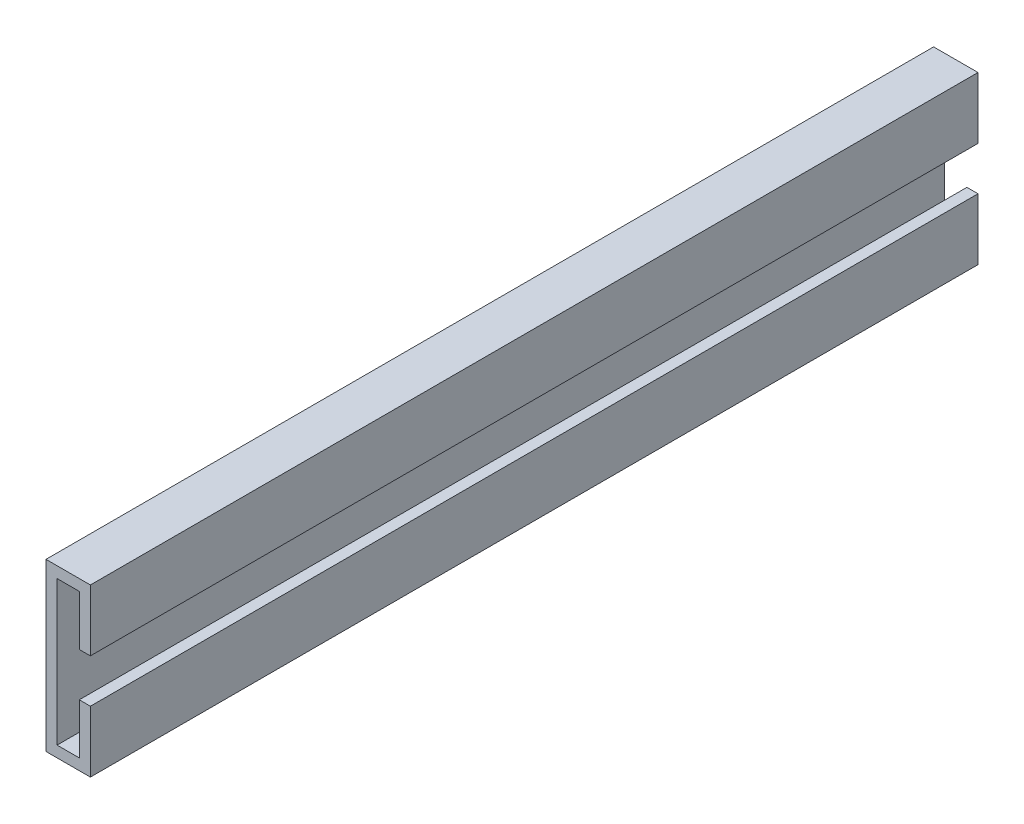
ISO-10303-21;
HEADER;
FILE_DESCRIPTION(('STEP AP214'),'2;1');
FILE_NAME('part.step','',(''),(''),'','','');
FILE_SCHEMA(('AUTOMOTIVE_DESIGN { 1 0 10303 214 1 1 1 1 }'));
ENDSEC;
DATA;
#1=APPLICATION_CONTEXT('core data for automotive mechanical design processes');
#2=APPLICATION_PROTOCOL_DEFINITION('international standard','automotive_design',2000,#1);
#3=PRODUCT_CONTEXT('',#1,'mechanical');
#4=PRODUCT('Part','Part','',(#3));
#5=PRODUCT_RELATED_PRODUCT_CATEGORY('part','',(#4));
#6=PRODUCT_DEFINITION_FORMATION('','',#4);
#7=PRODUCT_DEFINITION_CONTEXT('part definition',#1,'design');
#8=PRODUCT_DEFINITION('design','',#6,#7);
#9=PRODUCT_DEFINITION_SHAPE('','',#8);
#10=(LENGTH_UNIT() NAMED_UNIT(*) SI_UNIT(.MILLI.,.METRE.));
#11=(NAMED_UNIT(*) PLANE_ANGLE_UNIT() SI_UNIT($,.RADIAN.));
#12=(NAMED_UNIT(*) SI_UNIT($,.STERADIAN.) SOLID_ANGLE_UNIT());
#13=UNCERTAINTY_MEASURE_WITH_UNIT(LENGTH_MEASURE(1.E-05),#10,'distance_accuracy_value','');
#14=(GEOMETRIC_REPRESENTATION_CONTEXT(3) GLOBAL_UNCERTAINTY_ASSIGNED_CONTEXT((#13)) GLOBAL_UNIT_ASSIGNED_CONTEXT((#10,
#11,#12)) REPRESENTATION_CONTEXT('',''));
#15=CARTESIAN_POINT('',(0.,0.,0.));
#16=DIRECTION('',(0.,0.,1.));
#17=DIRECTION('',(1.,0.,0.));
#18=AXIS2_PLACEMENT_3D('',#15,#16,#17);
#19=CARTESIAN_POINT('',(0.,65.,400.));
#20=DIRECTION('',(0.,1.,0.));
#21=DIRECTION('',(0.,0.,1.));
#22=AXIS2_PLACEMENT_3D('',#19,#20,#21);
#23=PLANE('',#22);
#24=DIRECTION('',(1.,0.,0.));
#25=VECTOR('',#24,1.);
#26=CARTESIAN_POINT('',(0.,65.,-400.));
#27=LINE('',#26,#25);
#28=CARTESIAN_POINT('',(0.,65.,-400.));
#29=VERTEX_POINT('',#28);
#30=CARTESIAN_POINT('',(20.,65.,-400.));
#31=VERTEX_POINT('',#30);
#32=EDGE_CURVE('E164',#29,#31,#27,.T.);
#33=ORIENTED_EDGE('',*,*,#32,.T.);
#34=DIRECTION('',(0.,0.,-1.));
#35=VECTOR('',#34,1.);
#36=CARTESIAN_POINT('',(20.,65.,400.));
#37=LINE('',#36,#35);
#38=CARTESIAN_POINT('',(20.,65.,400.));
#39=VERTEX_POINT('',#38);
#40=EDGE_CURVE('E11',#39,#31,#37,.T.);
#41=ORIENTED_EDGE('',*,*,#40,.F.);
#42=DIRECTION('',(1.,0.,0.));
#43=VECTOR('',#42,1.);
#44=CARTESIAN_POINT('',(0.,65.,400.));
#45=LINE('',#44,#43);
#46=CARTESIAN_POINT('',(0.,65.,400.));
#47=VERTEX_POINT('',#46);
#48=EDGE_CURVE('E198',#47,#39,#45,.T.);
#49=ORIENTED_EDGE('',*,*,#48,.F.);
#50=DIRECTION('',(0.,0.,-1.));
#51=VECTOR('',#50,1.);
#52=CARTESIAN_POINT('',(0.,65.,400.));
#53=LINE('',#52,#51);
#54=EDGE_CURVE('E160',#47,#29,#53,.T.);
#55=ORIENTED_EDGE('',*,*,#54,.T.);
#56=EDGE_LOOP('',(#33,#41,#49,#55));
#57=FACE_BOUND('',#56,.T.);
#58=ADVANCED_FACE('F39',(#57),#23,.F.);
#59=CARTESIAN_POINT('',(20.,65.,400.));
#60=DIRECTION('',(1.,0.,0.));
#61=DIRECTION('',(0.,0.,-1.));
#62=AXIS2_PLACEMENT_3D('',#59,#60,#61);
#63=PLANE('',#62);
#64=DIRECTION('',(0.,-1.,0.));
#65=VECTOR('',#64,1.);
#66=CARTESIAN_POINT('',(20.,65.,-400.));
#67=LINE('',#66,#65);
#68=CARTESIAN_POINT('',(20.,19.6422644871285,-400.));
#69=VERTEX_POINT('',#68);
#70=EDGE_CURVE('E168',#31,#69,#67,.T.);
#71=ORIENTED_EDGE('',*,*,#70,.T.);
#72=DIRECTION('',(0.,0.,-1.));
#73=VECTOR('',#72,1.);
#74=CARTESIAN_POINT('',(20.,19.6422644871285,400.));
#75=LINE('',#74,#73);
#76=CARTESIAN_POINT('',(20.,19.6422644871285,400.));
#77=VERTEX_POINT('',#76);
#78=EDGE_CURVE('E48',#77,#69,#75,.T.);
#79=ORIENTED_EDGE('',*,*,#78,.F.);
#80=DIRECTION('',(0.,-1.,0.));
#81=VECTOR('',#80,1.);
#82=CARTESIAN_POINT('',(20.,65.,400.));
#83=LINE('',#82,#81);
#84=EDGE_CURVE('E111',#39,#77,#83,.T.);
#85=ORIENTED_EDGE('',*,*,#84,.F.);
#86=ORIENTED_EDGE('',*,*,#40,.T.);
#87=EDGE_LOOP('',(#71,#79,#85,#86));
#88=FACE_BOUND('',#87,.T.);
#89=ADVANCED_FACE('F292',(#88),#63,.F.);
#90=CARTESIAN_POINT('',(20.,19.6422644871285,400.));
#91=DIRECTION('',(0.,1.,0.));
#92=DIRECTION('',(-1.,0.,0.));
#93=AXIS2_PLACEMENT_3D('',#90,#91,#92);
#94=PLANE('',#93);
#95=DIRECTION('',(1.,0.,0.));
#96=VECTOR('',#95,1.);
#97=CARTESIAN_POINT('',(20.,19.6422644871285,-400.));
#98=LINE('',#97,#96);
#99=CARTESIAN_POINT('',(30.,19.6422644871285,-400.));
#100=VERTEX_POINT('',#99);
#101=EDGE_CURVE('E171',#69,#100,#98,.T.);
#102=ORIENTED_EDGE('',*,*,#101,.T.);
#103=DIRECTION('',(0.,0.,-1.));
#104=VECTOR('',#103,1.);
#105=CARTESIAN_POINT('',(30.,19.6422644871285,400.));
#106=LINE('',#105,#104);
#107=CARTESIAN_POINT('',(30.,19.6422644871285,400.));
#108=VERTEX_POINT('',#107);
#109=EDGE_CURVE('E225',#108,#100,#106,.T.);
#110=ORIENTED_EDGE('',*,*,#109,.F.);
#111=DIRECTION('',(1.,0.,0.));
#112=VECTOR('',#111,1.);
#113=CARTESIAN_POINT('',(20.,19.6422644871285,400.));
#114=LINE('',#113,#112);
#115=EDGE_CURVE('E235',#77,#108,#114,.T.);
#116=ORIENTED_EDGE('',*,*,#115,.F.);
#117=ORIENTED_EDGE('',*,*,#78,.T.);
#118=EDGE_LOOP('',(#102,#110,#116,#117));
#119=FACE_BOUND('',#118,.T.);
#120=ADVANCED_FACE('F233',(#119),#94,.F.);
#121=CARTESIAN_POINT('',(30.,19.6422644871285,400.));
#122=DIRECTION('',(-1.,0.,0.));
#123=DIRECTION('',(0.,0.,1.));
#124=AXIS2_PLACEMENT_3D('',#121,#122,#123);
#125=PLANE('',#124);
#126=DIRECTION('',(0.,1.,0.));
#127=VECTOR('',#126,1.);
#128=CARTESIAN_POINT('',(30.,19.6422644871285,-400.));
#129=LINE('',#128,#127);
#130=CARTESIAN_POINT('',(30.,75.,-400.));
#131=VERTEX_POINT('',#130);
#132=EDGE_CURVE('E174',#100,#131,#129,.T.);
#133=ORIENTED_EDGE('',*,*,#132,.T.);
#134=DIRECTION('',(0.,0.,-1.));
#135=VECTOR('',#134,1.);
#136=CARTESIAN_POINT('',(30.,75.,400.));
#137=LINE('',#136,#135);
#138=CARTESIAN_POINT('',(30.,75.,400.));
#139=VERTEX_POINT('',#138);
#140=EDGE_CURVE('E221',#139,#131,#137,.T.);
#141=ORIENTED_EDGE('',*,*,#140,.F.);
#142=DIRECTION('',(0.,1.,0.));
#143=VECTOR('',#142,1.);
#144=CARTESIAN_POINT('',(30.,19.6422644871285,400.));
#145=LINE('',#144,#143);
#146=EDGE_CURVE('E254',#108,#139,#145,.T.);
#147=ORIENTED_EDGE('',*,*,#146,.F.);
#148=ORIENTED_EDGE('',*,*,#109,.T.);
#149=EDGE_LOOP('',(#133,#141,#147,#148));
#150=FACE_BOUND('',#149,.T.);
#151=ADVANCED_FACE('F244',(#150),#125,.F.);
#152=CARTESIAN_POINT('',(30.,75.,400.));
#153=DIRECTION('',(0.,-1.,0.));
#154=DIRECTION('',(0.,0.,-1.));
#155=AXIS2_PLACEMENT_3D('',#152,#153,#154);
#156=PLANE('',#155);
#157=DIRECTION('',(-1.,0.,0.));
#158=VECTOR('',#157,1.);
#159=CARTESIAN_POINT('',(30.,75.,-400.));
#160=LINE('',#159,#158);
#161=CARTESIAN_POINT('',(-10.,75.,-400.));
#162=VERTEX_POINT('',#161);
#163=EDGE_CURVE('E177',#131,#162,#160,.T.);
#164=ORIENTED_EDGE('',*,*,#163,.T.);
#165=DIRECTION('',(0.,0.,-1.));
#166=VECTOR('',#165,1.);
#167=CARTESIAN_POINT('',(-10.,75.,400.));
#168=LINE('',#167,#166);
#169=CARTESIAN_POINT('',(-10.,75.,400.));
#170=VERTEX_POINT('',#169);
#171=EDGE_CURVE('E217',#170,#162,#168,.T.);
#172=ORIENTED_EDGE('',*,*,#171,.F.);
#173=DIRECTION('',(-1.,0.,0.));
#174=VECTOR('',#173,1.);
#175=CARTESIAN_POINT('',(30.,75.,400.));
#176=LINE('',#175,#174);
#177=EDGE_CURVE('E250',#139,#170,#176,.T.);
#178=ORIENTED_EDGE('',*,*,#177,.F.);
#179=ORIENTED_EDGE('',*,*,#140,.T.);
#180=EDGE_LOOP('',(#164,#172,#178,#179));
#181=FACE_BOUND('',#180,.T.);
#182=ADVANCED_FACE('F248',(#181),#156,.F.);
#183=CARTESIAN_POINT('',(-10.,75.,400.));
#184=DIRECTION('',(1.,0.,0.));
#185=DIRECTION('',(0.,0.,-1.));
#186=AXIS2_PLACEMENT_3D('',#183,#184,#185);
#187=PLANE('',#186);
#188=DIRECTION('',(0.,-1.,0.));
#189=VECTOR('',#188,1.);
#190=CARTESIAN_POINT('',(-10.,75.,-400.));
#191=LINE('',#190,#189);
#192=CARTESIAN_POINT('',(-10.,-75.,-400.));
#193=VERTEX_POINT('',#192);
#194=EDGE_CURVE('E180',#162,#193,#191,.T.);
#195=ORIENTED_EDGE('',*,*,#194,.T.);
#196=DIRECTION('',(0.,0.,-1.));
#197=VECTOR('',#196,1.);
#198=CARTESIAN_POINT('',(-10.,-75.,400.));
#199=LINE('',#198,#197);
#200=CARTESIAN_POINT('',(-10.,-75.,400.));
#201=VERTEX_POINT('',#200);
#202=EDGE_CURVE('E213',#201,#193,#199,.T.);
#203=ORIENTED_EDGE('',*,*,#202,.F.);
#204=DIRECTION('',(0.,-1.,0.));
#205=VECTOR('',#204,1.);
#206=CARTESIAN_POINT('',(-10.,75.,400.));
#207=LINE('',#206,#205);
#208=EDGE_CURVE('E253',#170,#201,#207,.T.);
#209=ORIENTED_EDGE('',*,*,#208,.F.);
#210=ORIENTED_EDGE('',*,*,#171,.T.);
#211=EDGE_LOOP('',(#195,#203,#209,#210));
#212=FACE_BOUND('',#211,.T.);
#213=ADVANCED_FACE('F305',(#212),#187,.F.);
#214=CARTESIAN_POINT('',(30.,-75.,400.));
#215=DIRECTION('',(0.,1.,0.));
#216=DIRECTION('',(0.,0.,1.));
#217=AXIS2_PLACEMENT_3D('',#214,#215,#216);
#218=PLANE('',#217);
#219=DIRECTION('',(1.,0.,0.));
#220=VECTOR('',#219,1.);
#221=CARTESIAN_POINT('',(30.,-75.,-400.));
#222=LINE('',#221,#220);
#223=CARTESIAN_POINT('',(30.,-75.,-400.));
#224=VERTEX_POINT('',#223);
#225=EDGE_CURVE('E183',#193,#224,#222,.T.);
#226=ORIENTED_EDGE('',*,*,#225,.T.);
#227=DIRECTION('',(0.,0.,-1.));
#228=VECTOR('',#227,1.);
#229=CARTESIAN_POINT('',(30.,-75.,400.));
#230=LINE('',#229,#228);
#231=CARTESIAN_POINT('',(30.,-75.,400.));
#232=VERTEX_POINT('',#231);
#233=EDGE_CURVE('E209',#232,#224,#230,.T.);
#234=ORIENTED_EDGE('',*,*,#233,.F.);
#235=DIRECTION('',(1.,0.,0.));
#236=VECTOR('',#235,1.);
#237=CARTESIAN_POINT('',(30.,-75.,400.));
#238=LINE('',#237,#236);
#239=EDGE_CURVE('E258',#201,#232,#238,.T.);
#240=ORIENTED_EDGE('',*,*,#239,.F.);
#241=ORIENTED_EDGE('',*,*,#202,.T.);
#242=EDGE_LOOP('',(#226,#234,#240,#241));
#243=FACE_BOUND('',#242,.T.);
#244=ADVANCED_FACE('F308',(#243),#218,.F.);
#245=CARTESIAN_POINT('',(30.,-19.6422644871285,400.));
#246=DIRECTION('',(-1.,0.,0.));
#247=DIRECTION('',(0.,0.,1.));
#248=AXIS2_PLACEMENT_3D('',#245,#246,#247);
#249=PLANE('',#248);
#250=DIRECTION('',(0.,1.,0.));
#251=VECTOR('',#250,1.);
#252=CARTESIAN_POINT('',(30.,-19.6422644871285,-400.));
#253=LINE('',#252,#251);
#254=CARTESIAN_POINT('',(30.,-19.6422644871285,-400.));
#255=VERTEX_POINT('',#254);
#256=EDGE_CURVE('E186',#224,#255,#253,.T.);
#257=ORIENTED_EDGE('',*,*,#256,.T.);
#258=DIRECTION('',(0.,0.,-1.));
#259=VECTOR('',#258,1.);
#260=CARTESIAN_POINT('',(30.,-19.6422644871285,400.));
#261=LINE('',#260,#259);
#262=CARTESIAN_POINT('',(30.,-19.6422644871285,400.));
#263=VERTEX_POINT('',#262);
#264=EDGE_CURVE('E205',#263,#255,#261,.T.);
#265=ORIENTED_EDGE('',*,*,#264,.F.);
#266=DIRECTION('',(0.,1.,0.));
#267=VECTOR('',#266,1.);
#268=CARTESIAN_POINT('',(30.,-19.6422644871285,400.));
#269=LINE('',#268,#267);
#270=EDGE_CURVE('E265',#232,#263,#269,.T.);
#271=ORIENTED_EDGE('',*,*,#270,.F.);
#272=ORIENTED_EDGE('',*,*,#233,.T.);
#273=EDGE_LOOP('',(#257,#265,#271,#272));
#274=FACE_BOUND('',#273,.T.);
#275=ADVANCED_FACE('F273',(#274),#249,.F.);
#276=CARTESIAN_POINT('',(20.,-19.6422644871285,400.));
#277=DIRECTION('',(0.,-1.,0.));
#278=DIRECTION('',(1.,0.,0.));
#279=AXIS2_PLACEMENT_3D('',#276,#277,#278);
#280=PLANE('',#279);
#281=DIRECTION('',(-1.,0.,0.));
#282=VECTOR('',#281,1.);
#283=CARTESIAN_POINT('',(20.,-19.6422644871285,-400.));
#284=LINE('',#283,#282);
#285=CARTESIAN_POINT('',(20.,-19.6422644871285,-400.));
#286=VERTEX_POINT('',#285);
#287=EDGE_CURVE('E189',#255,#286,#284,.T.);
#288=ORIENTED_EDGE('',*,*,#287,.T.);
#289=DIRECTION('',(0.,0.,-1.));
#290=VECTOR('',#289,1.);
#291=CARTESIAN_POINT('',(20.,-19.6422644871285,400.));
#292=LINE('',#291,#290);
#293=CARTESIAN_POINT('',(20.,-19.6422644871285,400.));
#294=VERTEX_POINT('',#293);
#295=EDGE_CURVE('E153',#294,#286,#292,.T.);
#296=ORIENTED_EDGE('',*,*,#295,.F.);
#297=DIRECTION('',(-1.,0.,0.));
#298=VECTOR('',#297,1.);
#299=CARTESIAN_POINT('',(20.,-19.6422644871285,400.));
#300=LINE('',#299,#298);
#301=EDGE_CURVE('E142',#263,#294,#300,.T.);
#302=ORIENTED_EDGE('',*,*,#301,.F.);
#303=ORIENTED_EDGE('',*,*,#264,.T.);
#304=EDGE_LOOP('',(#288,#296,#302,#303));
#305=FACE_BOUND('',#304,.T.);
#306=ADVANCED_FACE('F277',(#305),#280,.F.);
#307=CARTESIAN_POINT('',(20.,-65.,400.));
#308=DIRECTION('',(1.,0.,0.));
#309=DIRECTION('',(0.,0.,-1.));
#310=AXIS2_PLACEMENT_3D('',#307,#308,#309);
#311=PLANE('',#310);
#312=DIRECTION('',(0.,-1.,0.));
#313=VECTOR('',#312,1.);
#314=CARTESIAN_POINT('',(20.,-65.,-400.));
#315=LINE('',#314,#313);
#316=CARTESIAN_POINT('',(20.,-65.,-400.));
#317=VERTEX_POINT('',#316);
#318=EDGE_CURVE('E151',#286,#317,#315,.T.);
#319=ORIENTED_EDGE('',*,*,#318,.T.);
#320=DIRECTION('',(0.,0.,-1.));
#321=VECTOR('',#320,1.);
#322=CARTESIAN_POINT('',(20.,-65.,400.));
#323=LINE('',#322,#321);
#324=CARTESIAN_POINT('',(20.,-65.,400.));
#325=VERTEX_POINT('',#324);
#326=EDGE_CURVE('E148',#325,#317,#323,.T.);
#327=ORIENTED_EDGE('',*,*,#326,.F.);
#328=DIRECTION('',(0.,-1.,0.));
#329=VECTOR('',#328,1.);
#330=CARTESIAN_POINT('',(20.,-65.,400.));
#331=LINE('',#330,#329);
#332=EDGE_CURVE('E136',#294,#325,#331,.T.);
#333=ORIENTED_EDGE('',*,*,#332,.F.);
#334=ORIENTED_EDGE('',*,*,#295,.T.);
#335=EDGE_LOOP('',(#319,#327,#333,#334));
#336=FACE_BOUND('',#335,.T.);
#337=ADVANCED_FACE('F149',(#336),#311,.F.);
#338=CARTESIAN_POINT('',(0.,-65.,400.));
#339=DIRECTION('',(0.,-1.,0.));
#340=DIRECTION('',(0.,0.,-1.));
#341=AXIS2_PLACEMENT_3D('',#338,#339,#340);
#342=PLANE('',#341);
#343=DIRECTION('',(-1.,0.,0.));
#344=VECTOR('',#343,1.);
#345=CARTESIAN_POINT('',(0.,-65.,-400.));
#346=LINE('',#345,#344);
#347=CARTESIAN_POINT('',(0.,-65.,-400.));
#348=VERTEX_POINT('',#347);
#349=EDGE_CURVE('E97',#317,#348,#346,.T.);
#350=ORIENTED_EDGE('',*,*,#349,.T.);
#351=DIRECTION('',(0.,0.,-1.));
#352=VECTOR('',#351,1.);
#353=CARTESIAN_POINT('',(0.,-65.,400.));
#354=LINE('',#353,#352);
#355=CARTESIAN_POINT('',(0.,-65.,400.));
#356=VERTEX_POINT('',#355);
#357=EDGE_CURVE('E154',#356,#348,#354,.T.);
#358=ORIENTED_EDGE('',*,*,#357,.F.);
#359=DIRECTION('',(-1.,0.,0.));
#360=VECTOR('',#359,1.);
#361=CARTESIAN_POINT('',(0.,-65.,400.));
#362=LINE('',#361,#360);
#363=EDGE_CURVE('E140',#325,#356,#362,.T.);
#364=ORIENTED_EDGE('',*,*,#363,.F.);
#365=ORIENTED_EDGE('',*,*,#326,.T.);
#366=EDGE_LOOP('',(#350,#358,#364,#365));
#367=FACE_BOUND('',#366,.T.);
#368=ADVANCED_FACE('F156',(#367),#342,.F.);
#369=CARTESIAN_POINT('',(0.,-65.,400.));
#370=DIRECTION('',(-1.,0.,0.));
#371=DIRECTION('',(0.,0.,1.));
#372=AXIS2_PLACEMENT_3D('',#369,#370,#371);
#373=PLANE('',#372);
#374=DIRECTION('',(0.,1.,0.));
#375=VECTOR('',#374,1.);
#376=CARTESIAN_POINT('',(0.,-65.,-400.));
#377=LINE('',#376,#375);
#378=EDGE_CURVE('E103',#348,#29,#377,.T.);
#379=ORIENTED_EDGE('',*,*,#378,.T.);
#380=ORIENTED_EDGE('',*,*,#54,.F.);
#381=DIRECTION('',(0.,1.,0.));
#382=VECTOR('',#381,1.);
#383=CARTESIAN_POINT('',(0.,-65.,400.));
#384=LINE('',#383,#382);
#385=EDGE_CURVE('E56',#356,#47,#384,.T.);
#386=ORIENTED_EDGE('',*,*,#385,.F.);
#387=ORIENTED_EDGE('',*,*,#357,.T.);
#388=EDGE_LOOP('',(#379,#380,#386,#387));
#389=FACE_BOUND('',#388,.T.);
#390=ADVANCED_FACE('F281',(#389),#373,.F.);
#391=CARTESIAN_POINT('',(0.,0.,400.));
#392=DIRECTION('',(0.,0.,-1.));
#393=DIRECTION('',(-1.,0.,0.));
#394=AXIS2_PLACEMENT_3D('',#391,#392,#393);
#395=PLANE('',#394);
#396=ORIENTED_EDGE('',*,*,#48,.T.);
#397=ORIENTED_EDGE('',*,*,#84,.T.);
#398=ORIENTED_EDGE('',*,*,#115,.T.);
#399=ORIENTED_EDGE('',*,*,#146,.T.);
#400=ORIENTED_EDGE('',*,*,#177,.T.);
#401=ORIENTED_EDGE('',*,*,#208,.T.);
#402=ORIENTED_EDGE('',*,*,#239,.T.);
#403=ORIENTED_EDGE('',*,*,#270,.T.);
#404=ORIENTED_EDGE('',*,*,#301,.T.);
#405=ORIENTED_EDGE('',*,*,#332,.T.);
#406=ORIENTED_EDGE('',*,*,#363,.T.);
#407=ORIENTED_EDGE('',*,*,#385,.T.);
#408=EDGE_LOOP('',(#396,#397,#398,#399,#400,#401,#402,#403,#404,#405,#406,#407));
#409=FACE_BOUND('',#408,.T.);
#410=ADVANCED_FACE('F138',(#409),#395,.F.);
#411=CARTESIAN_POINT('',(0.,0.,-400.));
#412=DIRECTION('',(0.,0.,-1.));
#413=DIRECTION('',(-1.,0.,0.));
#414=AXIS2_PLACEMENT_3D('',#411,#412,#413);
#415=PLANE('',#414);
#416=ORIENTED_EDGE('',*,*,#32,.F.);
#417=ORIENTED_EDGE('',*,*,#378,.F.);
#418=ORIENTED_EDGE('',*,*,#349,.F.);
#419=ORIENTED_EDGE('',*,*,#318,.F.);
#420=ORIENTED_EDGE('',*,*,#287,.F.);
#421=ORIENTED_EDGE('',*,*,#256,.F.);
#422=ORIENTED_EDGE('',*,*,#225,.F.);
#423=ORIENTED_EDGE('',*,*,#194,.F.);
#424=ORIENTED_EDGE('',*,*,#163,.F.);
#425=ORIENTED_EDGE('',*,*,#132,.F.);
#426=ORIENTED_EDGE('',*,*,#101,.F.);
#427=ORIENTED_EDGE('',*,*,#70,.F.);
#428=EDGE_LOOP('',(#416,#417,#418,#419,#420,#421,#422,#423,#424,#425,#426,#427));
#429=FACE_BOUND('',#428,.T.);
#430=ADVANCED_FACE('F239',(#429),#415,.T.);
#431=CLOSED_SHELL('',(#58,#89,#120,#151,#182,#213,#244,#275,#306,#337,#368,#390,#410,#430));
#432=MANIFOLD_SOLID_BREP('B2',#431);
#433=ADVANCED_BREP_SHAPE_REPRESENTATION('',(#18,#432),#14);
#434=SHAPE_DEFINITION_REPRESENTATION(#9,#433);
ENDSEC;
END-ISO-10303-21;
